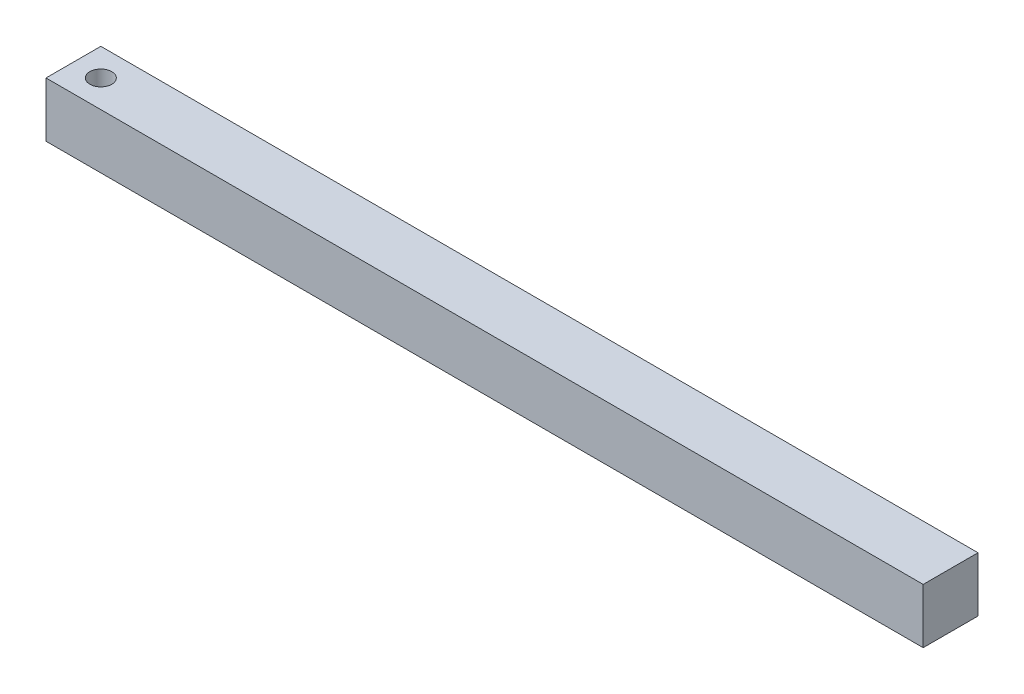
ISO-10303-21;
HEADER;
FILE_DESCRIPTION(('STEP AP214'),'2;1');
FILE_NAME('part.step','',(''),(''),'','','');
FILE_SCHEMA(('AUTOMOTIVE_DESIGN { 1 0 10303 214 1 1 1 1 }'));
ENDSEC;
DATA;
#1=APPLICATION_CONTEXT('core data for automotive mechanical design processes');
#2=APPLICATION_PROTOCOL_DEFINITION('international standard','automotive_design',2000,#1);
#3=PRODUCT_CONTEXT('',#1,'mechanical');
#4=PRODUCT('Part','Part','',(#3));
#5=PRODUCT_RELATED_PRODUCT_CATEGORY('part','',(#4));
#6=PRODUCT_DEFINITION_FORMATION('','',#4);
#7=PRODUCT_DEFINITION_CONTEXT('part definition',#1,'design');
#8=PRODUCT_DEFINITION('design','',#6,#7);
#9=PRODUCT_DEFINITION_SHAPE('','',#8);
#10=(LENGTH_UNIT() NAMED_UNIT(*) SI_UNIT(.MILLI.,.METRE.));
#11=(NAMED_UNIT(*) PLANE_ANGLE_UNIT() SI_UNIT($,.RADIAN.));
#12=(NAMED_UNIT(*) SI_UNIT($,.STERADIAN.) SOLID_ANGLE_UNIT());
#13=UNCERTAINTY_MEASURE_WITH_UNIT(LENGTH_MEASURE(1.E-05),#10,'distance_accuracy_value','');
#14=(GEOMETRIC_REPRESENTATION_CONTEXT(3) GLOBAL_UNCERTAINTY_ASSIGNED_CONTEXT((#13)) GLOBAL_UNIT_ASSIGNED_CONTEXT((#10,
#11,#12)) REPRESENTATION_CONTEXT('',''));
#15=CARTESIAN_POINT('',(0.,0.,0.));
#16=DIRECTION('',(0.,0.,1.));
#17=DIRECTION('',(1.,0.,0.));
#18=AXIS2_PLACEMENT_3D('',#15,#16,#17);
#19=CARTESIAN_POINT('',(0.,9.525,0.));
#20=DIRECTION('',(0.,-1.,0.));
#21=DIRECTION('',(0.,0.,-1.));
#22=AXIS2_PLACEMENT_3D('',#19,#20,#21);
#23=PLANE('',#22);
#24=DIRECTION('',(0.,0.,1.));
#25=VECTOR('',#24,1.);
#26=CARTESIAN_POINT('',(-4.7625,9.525,4.7625));
#27=LINE('',#26,#25);
#28=CARTESIAN_POINT('',(-4.7625,9.525,-4.7625));
#29=VERTEX_POINT('',#28);
#30=CARTESIAN_POINT('',(-4.7625,9.525,4.7625));
#31=VERTEX_POINT('',#30);
#32=EDGE_CURVE('E85',#29,#31,#27,.T.);
#33=ORIENTED_EDGE('',*,*,#32,.T.);
#34=DIRECTION('',(1.,0.,0.));
#35=VECTOR('',#34,1.);
#36=CARTESIAN_POINT('',(-4.7625,9.525,4.7625));
#37=LINE('',#36,#35);
#38=CARTESIAN_POINT('',(147.6375,9.525,4.7625));
#39=VERTEX_POINT('',#38);
#40=EDGE_CURVE('E80',#31,#39,#37,.T.);
#41=ORIENTED_EDGE('',*,*,#40,.T.);
#42=DIRECTION('',(0.,0.,-1.));
#43=VECTOR('',#42,1.);
#44=CARTESIAN_POINT('',(147.6375,9.525,4.7625));
#45=LINE('',#44,#43);
#46=CARTESIAN_POINT('',(147.6375,9.525,-4.7625));
#47=VERTEX_POINT('',#46);
#48=EDGE_CURVE('E83',#39,#47,#45,.T.);
#49=ORIENTED_EDGE('',*,*,#48,.T.);
#50=DIRECTION('',(-1.,0.,0.));
#51=VECTOR('',#50,1.);
#52=CARTESIAN_POINT('',(-4.7625,9.525,-4.7625));
#53=LINE('',#52,#51);
#54=EDGE_CURVE('E50',#47,#29,#53,.T.);
#55=ORIENTED_EDGE('',*,*,#54,.T.);
#56=EDGE_LOOP('',(#33,#41,#49,#55));
#57=FACE_BOUND('',#56,.T.);
#58=CARTESIAN_POINT('',(0.,9.525,0.));
#59=DIRECTION('',(0.,1.,0.));
#60=DIRECTION('',(0.,0.,1.));
#61=AXIS2_PLACEMENT_3D('',#58,#59,#60);
#62=CIRCLE('',#61,1.905);
#63=CARTESIAN_POINT('',(0.,9.525,1.905));
#64=VERTEX_POINT('',#63);
#65=EDGE_CURVE('E100',#64,#64,#62,.T.);
#66=ORIENTED_EDGE('',*,*,#65,.F.);
#67=EDGE_LOOP('',(#66));
#68=FACE_BOUND('',#67,.T.);
#69=ADVANCED_FACE('F33',(#57,#68),#23,.F.);
#70=CARTESIAN_POINT('',(0.,0.,0.));
#71=DIRECTION('',(0.,-1.,0.));
#72=DIRECTION('',(0.,0.,-1.));
#73=AXIS2_PLACEMENT_3D('',#70,#71,#72);
#74=PLANE('',#73);
#75=DIRECTION('',(0.,0.,1.));
#76=VECTOR('',#75,1.);
#77=CARTESIAN_POINT('',(-4.7625,0.,4.7625));
#78=LINE('',#77,#76);
#79=CARTESIAN_POINT('',(-4.7625,0.,-4.7625));
#80=VERTEX_POINT('',#79);
#81=CARTESIAN_POINT('',(-4.7625,0.,4.7625));
#82=VERTEX_POINT('',#81);
#83=EDGE_CURVE('E97',#80,#82,#78,.T.);
#84=ORIENTED_EDGE('',*,*,#83,.F.);
#85=DIRECTION('',(-1.,0.,0.));
#86=VECTOR('',#85,1.);
#87=CARTESIAN_POINT('',(-4.7625,0.,-4.7625));
#88=LINE('',#87,#86);
#89=CARTESIAN_POINT('',(147.6375,0.,-4.7625));
#90=VERTEX_POINT('',#89);
#91=EDGE_CURVE('E73',#90,#80,#88,.T.);
#92=ORIENTED_EDGE('',*,*,#91,.F.);
#93=DIRECTION('',(0.,0.,-1.));
#94=VECTOR('',#93,1.);
#95=CARTESIAN_POINT('',(147.6375,0.,4.7625));
#96=LINE('',#95,#94);
#97=CARTESIAN_POINT('',(147.6375,0.,4.7625));
#98=VERTEX_POINT('',#97);
#99=EDGE_CURVE('E67',#98,#90,#96,.T.);
#100=ORIENTED_EDGE('',*,*,#99,.F.);
#101=DIRECTION('',(1.,0.,0.));
#102=VECTOR('',#101,1.);
#103=CARTESIAN_POINT('',(-4.7625,0.,4.7625));
#104=LINE('',#103,#102);
#105=EDGE_CURVE('E89',#82,#98,#104,.T.);
#106=ORIENTED_EDGE('',*,*,#105,.F.);
#107=EDGE_LOOP('',(#84,#92,#100,#106));
#108=FACE_BOUND('',#107,.T.);
#109=CARTESIAN_POINT('',(0.,0.,0.));
#110=DIRECTION('',(0.,1.,0.));
#111=DIRECTION('',(0.,0.,1.));
#112=AXIS2_PLACEMENT_3D('',#109,#110,#111);
#113=CIRCLE('',#112,1.905);
#114=CARTESIAN_POINT('',(0.,0.,1.905));
#115=VERTEX_POINT('',#114);
#116=EDGE_CURVE('E112',#115,#115,#113,.T.);
#117=ORIENTED_EDGE('',*,*,#116,.T.);
#118=EDGE_LOOP('',(#117));
#119=FACE_BOUND('',#118,.T.);
#120=ADVANCED_FACE('F108',(#108,#119),#74,.T.);
#121=CARTESIAN_POINT('',(-4.7625,9.525,4.7625));
#122=DIRECTION('',(1.,0.,0.));
#123=DIRECTION('',(0.,0.,-1.));
#124=AXIS2_PLACEMENT_3D('',#121,#122,#123);
#125=PLANE('',#124);
#126=ORIENTED_EDGE('',*,*,#83,.T.);
#127=DIRECTION('',(0.,-1.,0.));
#128=VECTOR('',#127,1.);
#129=CARTESIAN_POINT('',(-4.7625,9.525,4.7625));
#130=LINE('',#129,#128);
#131=EDGE_CURVE('E11',#31,#82,#130,.T.);
#132=ORIENTED_EDGE('',*,*,#131,.F.);
#133=ORIENTED_EDGE('',*,*,#32,.F.);
#134=DIRECTION('',(0.,-1.,0.));
#135=VECTOR('',#134,1.);
#136=CARTESIAN_POINT('',(-4.7625,9.525,-4.7625));
#137=LINE('',#136,#135);
#138=EDGE_CURVE('E93',#29,#80,#137,.T.);
#139=ORIENTED_EDGE('',*,*,#138,.T.);
#140=EDGE_LOOP('',(#126,#132,#133,#139));
#141=FACE_BOUND('',#140,.T.);
#142=ADVANCED_FACE('F35',(#141),#125,.F.);
#143=CARTESIAN_POINT('',(-4.7625,9.525,4.7625));
#144=DIRECTION('',(0.,0.,-1.));
#145=DIRECTION('',(-1.,0.,0.));
#146=AXIS2_PLACEMENT_3D('',#143,#144,#145);
#147=PLANE('',#146);
#148=ORIENTED_EDGE('',*,*,#105,.T.);
#149=DIRECTION('',(0.,-1.,0.));
#150=VECTOR('',#149,1.);
#151=CARTESIAN_POINT('',(147.6375,9.525,4.7625));
#152=LINE('',#151,#150);
#153=EDGE_CURVE('E42',#39,#98,#152,.T.);
#154=ORIENTED_EDGE('',*,*,#153,.F.);
#155=ORIENTED_EDGE('',*,*,#40,.F.);
#156=ORIENTED_EDGE('',*,*,#131,.T.);
#157=EDGE_LOOP('',(#148,#154,#155,#156));
#158=FACE_BOUND('',#157,.T.);
#159=ADVANCED_FACE('F88',(#158),#147,.F.);
#160=CARTESIAN_POINT('',(147.6375,9.525,4.7625));
#161=DIRECTION('',(-1.,0.,0.));
#162=DIRECTION('',(0.,0.,1.));
#163=AXIS2_PLACEMENT_3D('',#160,#161,#162);
#164=PLANE('',#163);
#165=ORIENTED_EDGE('',*,*,#99,.T.);
#166=DIRECTION('',(0.,-1.,0.));
#167=VECTOR('',#166,1.);
#168=CARTESIAN_POINT('',(147.6375,9.525,-4.7625));
#169=LINE('',#168,#167);
#170=EDGE_CURVE('E90',#47,#90,#169,.T.);
#171=ORIENTED_EDGE('',*,*,#170,.F.);
#172=ORIENTED_EDGE('',*,*,#48,.F.);
#173=ORIENTED_EDGE('',*,*,#153,.T.);
#174=EDGE_LOOP('',(#165,#171,#172,#173));
#175=FACE_BOUND('',#174,.T.);
#176=ADVANCED_FACE('F91',(#175),#164,.F.);
#177=CARTESIAN_POINT('',(-4.7625,9.525,-4.7625));
#178=DIRECTION('',(0.,0.,1.));
#179=DIRECTION('',(1.,0.,0.));
#180=AXIS2_PLACEMENT_3D('',#177,#178,#179);
#181=PLANE('',#180);
#182=ORIENTED_EDGE('',*,*,#91,.T.);
#183=ORIENTED_EDGE('',*,*,#138,.F.);
#184=ORIENTED_EDGE('',*,*,#54,.F.);
#185=ORIENTED_EDGE('',*,*,#170,.T.);
#186=EDGE_LOOP('',(#182,#183,#184,#185));
#187=FACE_BOUND('',#186,.T.);
#188=ADVANCED_FACE('F105',(#187),#181,.F.);
#189=CARTESIAN_POINT('',(0.,9.525,0.));
#190=DIRECTION('',(0.,-1.,0.));
#191=DIRECTION('',(0.,0.,-1.));
#192=AXIS2_PLACEMENT_3D('',#189,#190,#191);
#193=CYLINDRICAL_SURFACE('',#192,1.905);
#194=ORIENTED_EDGE('',*,*,#65,.T.);
#195=EDGE_LOOP('',(#194));
#196=FACE_BOUND('',#195,.T.);
#197=ORIENTED_EDGE('',*,*,#116,.F.);
#198=EDGE_LOOP('',(#197));
#199=FACE_BOUND('',#198,.T.);
#200=ADVANCED_FACE('F118',(#196,#199),#193,.F.);
#201=CLOSED_SHELL('',(#69,#120,#142,#159,#176,#188,#200));
#202=MANIFOLD_SOLID_BREP('B2',#201);
#203=ADVANCED_BREP_SHAPE_REPRESENTATION('',(#18,#202),#14);
#204=SHAPE_DEFINITION_REPRESENTATION(#9,#203);
ENDSEC;
END-ISO-10303-21;
